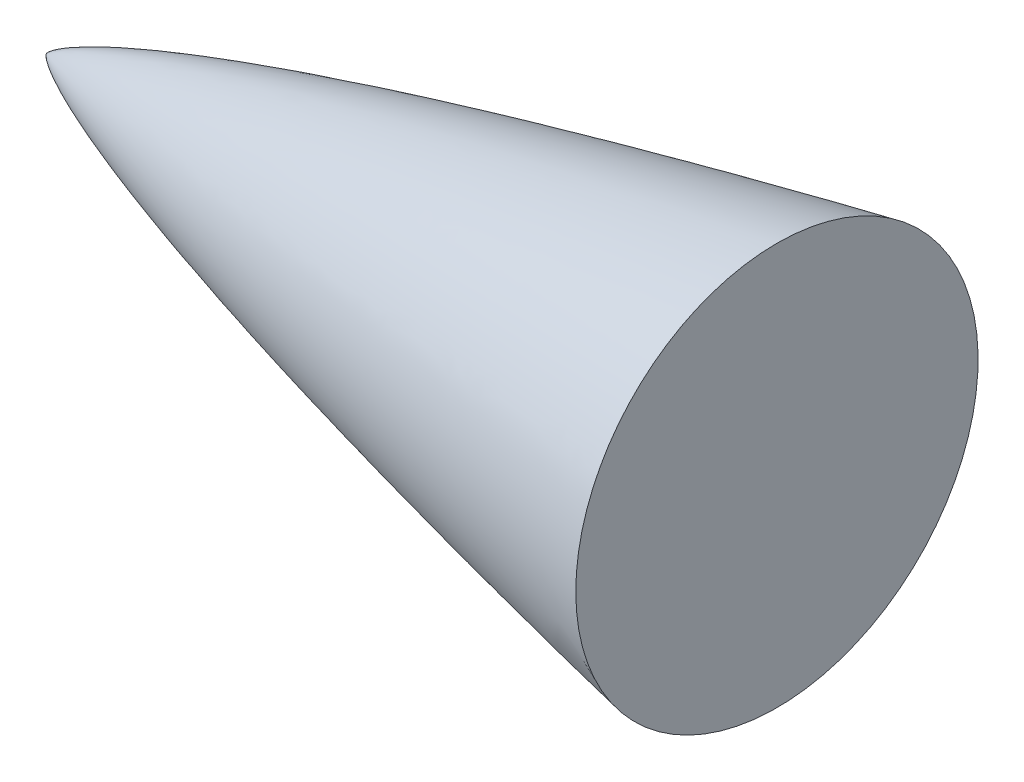
ISO-10303-21;
HEADER;
FILE_DESCRIPTION(('STEP AP214'),'2;1');
FILE_NAME('part.step','',(''),(''),'','','');
FILE_SCHEMA(('AUTOMOTIVE_DESIGN { 1 0 10303 214 1 1 1 1 }'));
ENDSEC;
DATA;
#1=APPLICATION_CONTEXT('core data for automotive mechanical design processes');
#2=APPLICATION_PROTOCOL_DEFINITION('international standard','automotive_design',2000,#1);
#3=PRODUCT_CONTEXT('',#1,'mechanical');
#4=PRODUCT('Part','Part','',(#3));
#5=PRODUCT_RELATED_PRODUCT_CATEGORY('part','',(#4));
#6=PRODUCT_DEFINITION_FORMATION('','',#4);
#7=PRODUCT_DEFINITION_CONTEXT('part definition',#1,'design');
#8=PRODUCT_DEFINITION('design','',#6,#7);
#9=PRODUCT_DEFINITION_SHAPE('','',#8);
#10=(LENGTH_UNIT() NAMED_UNIT(*) SI_UNIT(.MILLI.,.METRE.));
#11=(NAMED_UNIT(*) PLANE_ANGLE_UNIT() SI_UNIT($,.RADIAN.));
#12=(NAMED_UNIT(*) SI_UNIT($,.STERADIAN.) SOLID_ANGLE_UNIT());
#13=UNCERTAINTY_MEASURE_WITH_UNIT(LENGTH_MEASURE(1.E-05),#10,'distance_accuracy_value','');
#14=(GEOMETRIC_REPRESENTATION_CONTEXT(3) GLOBAL_UNCERTAINTY_ASSIGNED_CONTEXT((#13)) GLOBAL_UNIT_ASSIGNED_CONTEXT((#10,
#11,#12)) REPRESENTATION_CONTEXT('',''));
#15=CARTESIAN_POINT('',(0.,0.,0.));
#16=DIRECTION('',(0.,0.,1.));
#17=DIRECTION('',(1.,0.,0.));
#18=AXIS2_PLACEMENT_3D('',#15,#16,#17);
#19=CARTESIAN_POINT('',(44.4500000004159,12.240378040689,0.));
#20=CARTESIAN_POINT('',(43.6788006635201,12.0864445532193,0.));
#21=CARTESIAN_POINT('',(42.1417060285679,11.7769431055315,0.));
#22=CARTESIAN_POINT('',(39.1374851973871,11.1648544229738,0.));
#23=CARTESIAN_POINT('',(36.1346382602208,10.5305957316326,0.));
#24=CARTESIAN_POINT('',(32.5312271924216,9.75633427350668,0.));
#25=CARTESIAN_POINT('',(29.2981497280044,9.03364845745281,0.));
#26=CARTESIAN_POINT('',(25.8485751510912,8.24258304234528,0.));
#27=CARTESIAN_POINT('',(22.5404308491141,7.45104445598304,0.));
#28=CARTESIAN_POINT('',(19.1577013595814,6.61110028442712,0.));
#29=CARTESIAN_POINT('',(15.8351683774854,5.74326247031583,0.));
#30=CARTESIAN_POINT('',(12.4936826339344,4.82207604123956,0.));
#31=CARTESIAN_POINT('',(9.2264135000062,3.85530066745851,0.));
#32=CARTESIAN_POINT('',(6.38160109756721,2.93589634240436,0.));
#33=CARTESIAN_POINT('',(4.09295059048071,2.1112474072146,0.));
#34=CARTESIAN_POINT('',(2.46279613714016,1.44279331277761,0.));
#35=CARTESIAN_POINT('',(1.51138898746803,1.00171877350411,0.));
#36=CARTESIAN_POINT('',(0.901635525855378,0.680174208192614,0.));
#37=CARTESIAN_POINT('',(0.544576148651443,0.465759826176482,0.));
#38=CARTESIAN_POINT('',(0.332159509319544,0.321448771590401,0.));
#39=CARTESIAN_POINT('',(0.205163795357649,0.223773559567609,0.));
#40=CARTESIAN_POINT('',(0.128401711958068,0.157512982083522,0.));
#41=CARTESIAN_POINT('',(0.0811094624160586,0.111493123976811,0.));
#42=CARTESIAN_POINT('',(0.049584293607688,0.0773382435931133,0.));
#43=CARTESIAN_POINT('',(0.0258665297589546,0.0476780016360019,0.));
#44=CARTESIAN_POINT('',(0.0105511334228714,0.0262748295682255,0.));
#45=CARTESIAN_POINT('',(0.00301199312596559,0.00976290506833397,0.));
#46=CARTESIAN_POINT('',(0.,0.,0.));
#47=B_SPLINE_CURVE_WITH_KNOTS('',4,(#19,#20,#21,#22,#23,#24,#25,#26,#27,#28,#29,#30,#31,#32,#33,
#34,#35,#36,#37,#38,#39,#40,#41,#42,#43,#44,#45,#46),.UNSPECIFIED.,.F.,.F.,(5,1,1,1,1,1,1,1,1,1,
1,1,1,1,1,1,1,1,1,1,1,1,1,1,5),(0.,0.0679699247447034,0.135939850086695,0.203909775666147,
0.271879701225602,0.339849626915148,0.407819554162289,0.475789477500531,0.543759405711302,
0.611729329072371,0.679699256244739,0.74766917223563,0.812633032445138,0.846617954440517,
0.871417624470559,0.886197237314542,0.895231685431673,0.900819023352621,0.904212610393516,
0.906389882922733,0.907845489022244,0.908792492333234,0.909409182618713,0.910041707218584,
0.910842976076171),.UNSPECIFIED.);
#48=CARTESIAN_POINT('',(0.,0.,0.));
#49=DIRECTION('',(-1.,0.,0.));
#50=AXIS1_PLACEMENT('',#48,#49);
#51=SURFACE_OF_REVOLUTION('',#47,#50);
#52=CARTESIAN_POINT('',(0.,0.,0.));
#53=VERTEX_POINT('',#52);
#54=VERTEX_LOOP('',#53);
#55=FACE_BOUND('',#54,.T.);
#56=CARTESIAN_POINT('',(44.45,0.,0.));
#57=DIRECTION('',(-1.,0.,0.));
#58=DIRECTION('',(0.,0.,1.));
#59=AXIS2_PLACEMENT_3D('',#56,#57,#58);
#60=CIRCLE('',#59,12.2403780405745);
#61=CARTESIAN_POINT('',(44.45,0.,12.2403780405745));
#62=VERTEX_POINT('',#61);
#63=EDGE_CURVE('E11',#62,#62,#60,.T.);
#64=ORIENTED_EDGE('',*,*,#63,.T.);
#65=EDGE_LOOP('',(#64));
#66=FACE_BOUND('',#65,.T.);
#67=ADVANCED_FACE('F33',(#55,#66),#51,.T.);
#68=CARTESIAN_POINT('',(44.45,0.,0.));
#69=DIRECTION('',(-1.,0.,0.));
#70=DIRECTION('',(0.,0.,1.));
#71=AXIS2_PLACEMENT_3D('',#68,#69,#70);
#72=PLANE('',#71);
#73=ORIENTED_EDGE('',*,*,#63,.F.);
#74=EDGE_LOOP('',(#73));
#75=FACE_BOUND('',#74,.T.);
#76=ADVANCED_FACE('F43',(#75),#72,.F.);
#77=CLOSED_SHELL('',(#67,#76));
#78=MANIFOLD_SOLID_BREP('B2',#77);
#79=ADVANCED_BREP_SHAPE_REPRESENTATION('',(#18,#78),#14);
#80=SHAPE_DEFINITION_REPRESENTATION(#9,#79);
ENDSEC;
END-ISO-10303-21;
